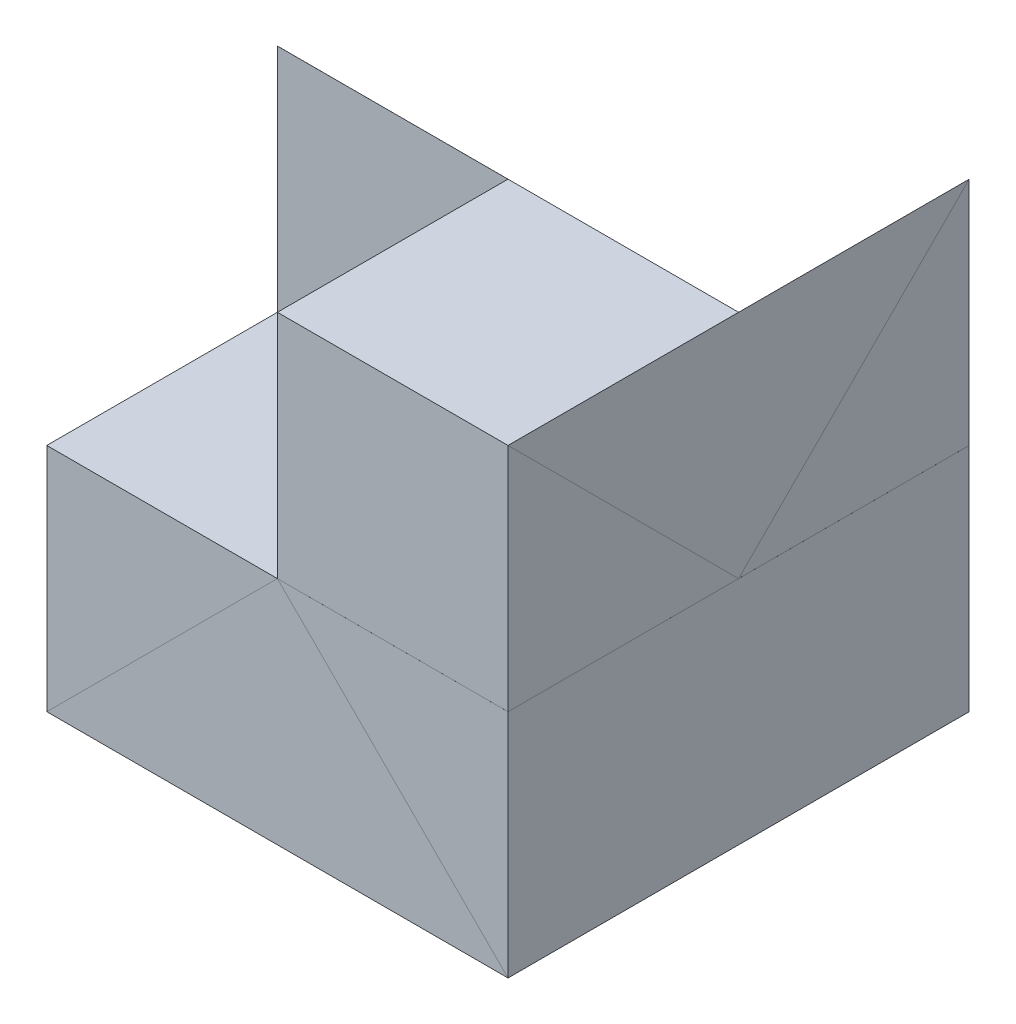
ISO-10303-21;
HEADER;
FILE_DESCRIPTION(('STEP AP214'),'2;1');
FILE_NAME('part.step','',(''),(''),'','','');
FILE_SCHEMA(('AUTOMOTIVE_DESIGN { 1 0 10303 214 1 1 1 1 }'));
ENDSEC;
DATA;
#1=APPLICATION_CONTEXT('core data for automotive mechanical design processes');
#2=APPLICATION_PROTOCOL_DEFINITION('international standard','automotive_design',2000,#1);
#3=PRODUCT_CONTEXT('',#1,'mechanical');
#4=PRODUCT('Part','Part','',(#3));
#5=PRODUCT_RELATED_PRODUCT_CATEGORY('part','',(#4));
#6=PRODUCT_DEFINITION_FORMATION('','',#4);
#7=PRODUCT_DEFINITION_CONTEXT('part definition',#1,'design');
#8=PRODUCT_DEFINITION('design','',#6,#7);
#9=PRODUCT_DEFINITION_SHAPE('','',#8);
#10=(LENGTH_UNIT() NAMED_UNIT(*) SI_UNIT(.MILLI.,.METRE.));
#11=(NAMED_UNIT(*) PLANE_ANGLE_UNIT() SI_UNIT($,.RADIAN.));
#12=(NAMED_UNIT(*) SI_UNIT($,.STERADIAN.) SOLID_ANGLE_UNIT());
#13=UNCERTAINTY_MEASURE_WITH_UNIT(LENGTH_MEASURE(1.E-05),#10,'distance_accuracy_value','');
#14=(GEOMETRIC_REPRESENTATION_CONTEXT(3) GLOBAL_UNCERTAINTY_ASSIGNED_CONTEXT((#13)) GLOBAL_UNIT_ASSIGNED_CONTEXT((#10,
#11,#12)) REPRESENTATION_CONTEXT('',''));
#15=CARTESIAN_POINT('',(0.,0.,0.));
#16=DIRECTION('',(0.,0.,1.));
#17=DIRECTION('',(1.,0.,0.));
#18=AXIS2_PLACEMENT_3D('',#15,#16,#17);
#19=CARTESIAN_POINT('',(0.,0.,30.));
#20=DIRECTION('',(-0.707106781186548,0.707106781186548,0.));
#21=DIRECTION('',(-0.707106781186548,-0.707106781186548,0.));
#22=AXIS2_PLACEMENT_3D('',#19,#20,#21);
#23=PLANE('',#22);
#24=DIRECTION('',(-0.707106781186547,-0.707106781186547,0.));
#25=VECTOR('',#24,1.);
#26=CARTESIAN_POINT('',(0.,0.,40.));
#27=LINE('',#26,#25);
#28=CARTESIAN_POINT('',(19.999,19.999,40.));
#29=VERTEX_POINT('',#28);
#30=CARTESIAN_POINT('',(0.,0.,40.));
#31=VERTEX_POINT('',#30);
#32=EDGE_CURVE('E280',#29,#31,#27,.T.);
#33=ORIENTED_EDGE('',*,*,#32,.T.);
#34=DIRECTION('',(0.577340646203995,0.577340646203995,-0.577369514679729));
#35=VECTOR('',#34,1.);
#36=CARTESIAN_POINT('',(3.33338888703682,3.33338888703682,36.6664444351849));
#37=LINE('',#36,#35);
#38=CARTESIAN_POINT('',(0.0001,9.99999999997031E-05,39.9998999949998));
#39=VERTEX_POINT('',#38);
#40=EDGE_CURVE('E200',#31,#39,#37,.T.);
#41=ORIENTED_EDGE('',*,*,#40,.T.);
#42=DIRECTION('',(0.,0.,-1.));
#43=VECTOR('',#42,1.);
#44=CARTESIAN_POINT('',(0.0001,0.0001,30.));
#45=LINE('',#44,#43);
#46=CARTESIAN_POINT('',(0.0001,0.0001,39.998));
#47=VERTEX_POINT('',#46);
#48=EDGE_CURVE('E178',#39,#47,#45,.T.);
#49=ORIENTED_EDGE('',*,*,#48,.T.);
#50=DIRECTION('',(-0.707106781186548,-0.707106781186547,0.));
#51=VECTOR('',#50,1.);
#52=CARTESIAN_POINT('',(0.,0.,39.998));
#53=LINE('',#52,#51);
#54=CARTESIAN_POINT('',(19.999,19.999,39.998));
#55=VERTEX_POINT('',#54);
#56=EDGE_CURVE('E203',#55,#47,#53,.T.);
#57=ORIENTED_EDGE('',*,*,#56,.F.);
#58=DIRECTION('',(0.,0.,1.));
#59=VECTOR('',#58,1.);
#60=CARTESIAN_POINT('',(19.999,19.999,30.));
#61=LINE('',#60,#59);
#62=EDGE_CURVE('E283',#55,#29,#61,.T.);
#63=ORIENTED_EDGE('',*,*,#62,.T.);
#64=EDGE_LOOP('',(#33,#41,#49,#57,#63));
#65=FACE_BOUND('',#64,.T.);
#66=ADVANCED_FACE('F33',(#65),#23,.F.);
#67=CARTESIAN_POINT('',(19.999,19.999,30.));
#68=DIRECTION('',(0.707071424963649,0.707142135641679,0.));
#69=DIRECTION('',(-0.707142135641679,0.707071424963649,0.));
#70=AXIS2_PLACEMENT_3D('',#67,#68,#69);
#71=PLANE('',#70);
#72=DIRECTION('',(-0.707142135641679,0.707071424963649,0.));
#73=VECTOR('',#72,1.);
#74=CARTESIAN_POINT('',(19.999,19.999,39.998));
#75=LINE('',#74,#73);
#76=CARTESIAN_POINT('',(40.,0.,39.998));
#77=VERTEX_POINT('',#76);
#78=EDGE_CURVE('E41',#77,#55,#75,.T.);
#79=ORIENTED_EDGE('',*,*,#78,.F.);
#80=DIRECTION('',(0.,0.,-1.));
#81=VECTOR('',#80,1.);
#82=CARTESIAN_POINT('',(40.,0.,40.));
#83=LINE('',#82,#81);
#84=CARTESIAN_POINT('',(40.,0.,40.));
#85=VERTEX_POINT('',#84);
#86=EDGE_CURVE('E326',#85,#77,#83,.T.);
#87=ORIENTED_EDGE('',*,*,#86,.F.);
#88=DIRECTION('',(-0.707142135641679,0.707071424963649,0.));
#89=VECTOR('',#88,1.);
#90=CARTESIAN_POINT('',(19.999,19.999,40.));
#91=LINE('',#90,#89);
#92=EDGE_CURVE('E277',#85,#29,#91,.T.);
#93=ORIENTED_EDGE('',*,*,#92,.T.);
#94=ORIENTED_EDGE('',*,*,#62,.F.);
#95=EDGE_LOOP('',(#79,#87,#93,#94));
#96=FACE_BOUND('',#95,.T.);
#97=ADVANCED_FACE('F340',(#96),#71,.F.);
#98=CARTESIAN_POINT('',(0.,0.,39.999));
#99=DIRECTION('',(0.,0.,-1.));
#100=DIRECTION('',(-1.,0.,0.));
#101=AXIS2_PLACEMENT_3D('',#98,#99,#100);
#102=PLANE('',#101);
#103=DIRECTION('',(0.,-1.,0.));
#104=VECTOR('',#103,1.);
#105=CARTESIAN_POINT('',(39.9999,0.,39.999));
#106=LINE('',#105,#104);
#107=CARTESIAN_POINT('',(39.9999,40.,39.999));
#108=VERTEX_POINT('',#107);
#109=CARTESIAN_POINT('',(39.9999,20.,39.999));
#110=VERTEX_POINT('',#109);
#111=EDGE_CURVE('E335',#108,#110,#106,.T.);
#112=ORIENTED_EDGE('',*,*,#111,.F.);
#113=DIRECTION('',(-1.,0.,0.));
#114=VECTOR('',#113,1.);
#115=CARTESIAN_POINT('',(40.,40.,39.999));
#116=LINE('',#115,#114);
#117=CARTESIAN_POINT('',(20.,40.,39.999));
#118=VERTEX_POINT('',#117);
#119=EDGE_CURVE('E235',#108,#118,#116,.T.);
#120=ORIENTED_EDGE('',*,*,#119,.T.);
#121=DIRECTION('',(0.,-1.,0.));
#122=VECTOR('',#121,1.);
#123=CARTESIAN_POINT('',(20.,40.,39.999));
#124=LINE('',#123,#122);
#125=CARTESIAN_POINT('',(20.,20.,39.999));
#126=VERTEX_POINT('',#125);
#127=EDGE_CURVE('E239',#118,#126,#124,.T.);
#128=ORIENTED_EDGE('',*,*,#127,.T.);
#129=DIRECTION('',(1.,0.,0.));
#130=VECTOR('',#129,1.);
#131=CARTESIAN_POINT('',(40.,20.,39.999));
#132=LINE('',#131,#130);
#133=EDGE_CURVE('E242',#126,#110,#132,.T.);
#134=ORIENTED_EDGE('',*,*,#133,.T.);
#135=EDGE_LOOP('',(#112,#120,#128,#134));
#136=FACE_BOUND('',#135,.T.);
#137=ADVANCED_FACE('F376',(#136),#102,.F.);
#138=CARTESIAN_POINT('',(40.,20.,20.));
#139=DIRECTION('',(0.,-1.,0.));
#140=DIRECTION('',(1.,0.,0.));
#141=AXIS2_PLACEMENT_3D('',#138,#139,#140);
#142=PLANE('',#141);
#143=DIRECTION('',(0.,0.,1.));
#144=VECTOR('',#143,1.);
#145=CARTESIAN_POINT('',(40.,20.,20.));
#146=LINE('',#145,#144);
#147=CARTESIAN_POINT('',(40.,20.,20.001));
#148=VERTEX_POINT('',#147);
#149=CARTESIAN_POINT('',(40.,20.,40.));
#150=VERTEX_POINT('',#149);
#151=EDGE_CURVE('E303',#148,#150,#146,.T.);
#152=ORIENTED_EDGE('',*,*,#151,.F.);
#153=DIRECTION('',(1.,0.,0.));
#154=VECTOR('',#153,1.);
#155=CARTESIAN_POINT('',(39.9999,20.,20.001));
#156=LINE('',#155,#154);
#157=CARTESIAN_POINT('',(39.9999,20.,20.001));
#158=VERTEX_POINT('',#157);
#159=EDGE_CURVE('E231',#158,#148,#156,.T.);
#160=ORIENTED_EDGE('',*,*,#159,.F.);
#161=DIRECTION('',(0.,0.,-1.));
#162=VECTOR('',#161,1.);
#163=CARTESIAN_POINT('',(39.9999,20.,40.));
#164=LINE('',#163,#162);
#165=EDGE_CURVE('E227',#110,#158,#164,.T.);
#166=ORIENTED_EDGE('',*,*,#165,.F.);
#167=ORIENTED_EDGE('',*,*,#133,.F.);
#168=DIRECTION('',(0.,0.,-1.));
#169=VECTOR('',#168,1.);
#170=CARTESIAN_POINT('',(20.,20.,39.999));
#171=LINE('',#170,#169);
#172=CARTESIAN_POINT('',(20.,20.,20.002));
#173=VERTEX_POINT('',#172);
#174=EDGE_CURVE('E245',#126,#173,#171,.T.);
#175=ORIENTED_EDGE('',*,*,#174,.T.);
#176=DIRECTION('',(1.,0.,0.));
#177=VECTOR('',#176,1.);
#178=CARTESIAN_POINT('',(0.,20.,20.002));
#179=LINE('',#178,#177);
#180=CARTESIAN_POINT('',(0.,20.,20.002));
#181=VERTEX_POINT('',#180);
#182=EDGE_CURVE('E209',#181,#173,#179,.T.);
#183=ORIENTED_EDGE('',*,*,#182,.F.);
#184=DIRECTION('',(0.,0.,1.));
#185=VECTOR('',#184,1.);
#186=CARTESIAN_POINT('',(0.,20.,30.));
#187=LINE('',#186,#185);
#188=CARTESIAN_POINT('',(0.,20.,40.));
#189=VERTEX_POINT('',#188);
#190=EDGE_CURVE('E296',#181,#189,#187,.T.);
#191=ORIENTED_EDGE('',*,*,#190,.T.);
#192=DIRECTION('',(1.,0.,0.));
#193=VECTOR('',#192,1.);
#194=CARTESIAN_POINT('',(40.,20.,40.));
#195=LINE('',#194,#193);
#196=EDGE_CURVE('E301',#189,#150,#195,.T.);
#197=ORIENTED_EDGE('',*,*,#196,.T.);
#198=EDGE_LOOP('',(#152,#160,#166,#167,#175,#183,#191,#197));
#199=FACE_BOUND('',#198,.T.);
#200=ADVANCED_FACE('F390',(#199),#142,.F.);
#201=CARTESIAN_POINT('',(0.,40.,40.));
#202=DIRECTION('',(0.,-1.,0.));
#203=DIRECTION('',(0.,0.,-1.));
#204=AXIS2_PLACEMENT_3D('',#201,#202,#203);
#205=PLANE('',#204);
#206=DIRECTION('',(-1.,0.,0.));
#207=VECTOR('',#206,1.);
#208=CARTESIAN_POINT('',(0.,40.,20.002));
#209=LINE('',#208,#207);
#210=CARTESIAN_POINT('',(20.,40.,20.002));
#211=VERTEX_POINT('',#210);
#212=CARTESIAN_POINT('',(0.,40.,20.002));
#213=VERTEX_POINT('',#212);
#214=EDGE_CURVE('E215',#211,#213,#209,.T.);
#215=ORIENTED_EDGE('',*,*,#214,.F.);
#216=DIRECTION('',(0.,0.,-1.));
#217=VECTOR('',#216,1.);
#218=CARTESIAN_POINT('',(20.,40.,39.999));
#219=LINE('',#218,#217);
#220=EDGE_CURVE('E247',#118,#211,#219,.T.);
#221=ORIENTED_EDGE('',*,*,#220,.F.);
#222=ORIENTED_EDGE('',*,*,#119,.F.);
#223=CARTESIAN_POINT('',(40.,40.,39.999));
#224=VERTEX_POINT('',#223);
#225=EDGE_CURVE('E236',#224,#108,#116,.T.);
#226=ORIENTED_EDGE('',*,*,#225,.F.);
#227=DIRECTION('',(0.,0.,-1.));
#228=VECTOR('',#227,1.);
#229=CARTESIAN_POINT('',(40.,40.,40.));
#230=LINE('',#229,#228);
#231=CARTESIAN_POINT('',(40.,40.,20.));
#232=VERTEX_POINT('',#231);
#233=EDGE_CURVE('E322',#224,#232,#230,.T.);
#234=ORIENTED_EDGE('',*,*,#233,.T.);
#235=DIRECTION('',(1.,0.,0.));
#236=VECTOR('',#235,1.);
#237=CARTESIAN_POINT('',(0.,40.,20.));
#238=LINE('',#237,#236);
#239=CARTESIAN_POINT('',(0.,40.,20.));
#240=VERTEX_POINT('',#239);
#241=EDGE_CURVE('E285',#240,#232,#238,.T.);
#242=ORIENTED_EDGE('',*,*,#241,.F.);
#243=DIRECTION('',(0.,0.,-1.));
#244=VECTOR('',#243,1.);
#245=CARTESIAN_POINT('',(0.,40.,20.001));
#246=LINE('',#245,#244);
#247=CARTESIAN_POINT('',(0.,40.,20.0009));
#248=VERTEX_POINT('',#247);
#249=EDGE_CURVE('E269',#248,#240,#246,.T.);
#250=ORIENTED_EDGE('',*,*,#249,.F.);
#251=DIRECTION('',(0.,0.,-1.));
#252=VECTOR('',#251,1.);
#253=CARTESIAN_POINT('',(0.,40.,40.));
#254=LINE('',#253,#252);
#255=EDGE_CURVE('E314',#213,#248,#254,.T.);
#256=ORIENTED_EDGE('',*,*,#255,.F.);
#257=EDGE_LOOP('',(#215,#221,#222,#226,#234,#242,#250,#256));
#258=FACE_BOUND('',#257,.T.);
#259=ADVANCED_FACE('F370',(#258),#205,.F.);
#260=CARTESIAN_POINT('',(0.,0.,40.));
#261=DIRECTION('',(1.,0.,0.));
#262=DIRECTION('',(0.,0.,-1.));
#263=AXIS2_PLACEMENT_3D('',#260,#261,#262);
#264=PLANE('',#263);
#265=DIRECTION('',(0.,-1.,0.));
#266=VECTOR('',#265,1.);
#267=CARTESIAN_POINT('',(0.,0.,0.));
#268=LINE('',#267,#266);
#269=CARTESIAN_POINT('',(0.,20.,0.));
#270=VERTEX_POINT('',#269);
#271=CARTESIAN_POINT('',(0.,0.,0.));
#272=VERTEX_POINT('',#271);
#273=EDGE_CURVE('E306',#270,#272,#268,.T.);
#274=ORIENTED_EDGE('',*,*,#273,.T.);
#275=DIRECTION('',(0.,-0.707089102854089,-0.707124459077042));
#276=VECTOR('',#275,1.);
#277=CARTESIAN_POINT('',(0.,0.,0.));
#278=LINE('',#277,#276);
#279=CARTESIAN_POINT('',(0.,19.999,20.));
#280=VERTEX_POINT('',#279);
#281=EDGE_CURVE('E197',#280,#272,#278,.T.);
#282=ORIENTED_EDGE('',*,*,#281,.F.);
#283=DIRECTION('',(0.,0.707089102854089,-0.707124459077042));
#284=VECTOR('',#283,1.);
#285=CARTESIAN_POINT('',(0.,19.999,20.));
#286=LINE('',#285,#284);
#287=EDGE_CURVE('E186',#31,#280,#286,.T.);
#288=ORIENTED_EDGE('',*,*,#287,.F.);
#289=DIRECTION('',(0.,-1.,0.));
#290=VECTOR('',#289,1.);
#291=CARTESIAN_POINT('',(0.,0.,40.));
#292=LINE('',#291,#290);
#293=EDGE_CURVE('E307',#189,#31,#292,.T.);
#294=ORIENTED_EDGE('',*,*,#293,.F.);
#295=ORIENTED_EDGE('',*,*,#190,.F.);
#296=DIRECTION('',(0.,-1.,0.));
#297=VECTOR('',#296,1.);
#298=CARTESIAN_POINT('',(0.,40.,20.002));
#299=LINE('',#298,#297);
#300=EDGE_CURVE('E206',#213,#181,#299,.T.);
#301=ORIENTED_EDGE('',*,*,#300,.F.);
#302=ORIENTED_EDGE('',*,*,#255,.T.);
#303=DIRECTION('',(0.,1.,0.));
#304=VECTOR('',#303,1.);
#305=CARTESIAN_POINT('',(0.,20.,20.0009));
#306=LINE('',#305,#304);
#307=CARTESIAN_POINT('',(0.,20.,20.0009));
#308=VERTEX_POINT('',#307);
#309=EDGE_CURVE('E223',#308,#248,#306,.T.);
#310=ORIENTED_EDGE('',*,*,#309,.F.);
#311=DIRECTION('',(0.,0.,1.));
#312=VECTOR('',#311,1.);
#313=CARTESIAN_POINT('',(0.,20.,0.));
#314=LINE('',#313,#312);
#315=EDGE_CURVE('E272',#270,#308,#314,.T.);
#316=ORIENTED_EDGE('',*,*,#315,.F.);
#317=EDGE_LOOP('',(#274,#282,#288,#294,#295,#301,#302,#310,#316));
#318=FACE_BOUND('',#317,.T.);
#319=ADVANCED_FACE('F35',(#318),#264,.F.);
#320=CARTESIAN_POINT('',(0.,0.,40.));
#321=DIRECTION('',(0.,1.,0.));
#322=DIRECTION('',(0.,0.,1.));
#323=AXIS2_PLACEMENT_3D('',#320,#321,#322);
#324=PLANE('',#323);
#325=DIRECTION('',(1.,0.,0.));
#326=VECTOR('',#325,1.);
#327=CARTESIAN_POINT('',(40.,0.,39.998));
#328=LINE('',#327,#326);
#329=CARTESIAN_POINT('',(0.000100000000002876,0.,39.998));
#330=VERTEX_POINT('',#329);
#331=EDGE_CURVE('E54',#330,#77,#328,.T.);
#332=ORIENTED_EDGE('',*,*,#331,.F.);
#333=DIRECTION('',(0.,0.,1.));
#334=VECTOR('',#333,1.);
#335=CARTESIAN_POINT('',(0.0001,0.,40.));
#336=LINE('',#335,#334);
#337=CARTESIAN_POINT('',(0.0001,0.,0.));
#338=VERTEX_POINT('',#337);
#339=EDGE_CURVE('E48',#338,#330,#336,.T.);
#340=ORIENTED_EDGE('',*,*,#339,.F.);
#341=DIRECTION('',(1.,0.,0.));
#342=VECTOR('',#341,1.);
#343=CARTESIAN_POINT('',(0.,0.,0.));
#344=LINE('',#343,#342);
#345=CARTESIAN_POINT('',(40.,0.,0.));
#346=VERTEX_POINT('',#345);
#347=EDGE_CURVE('E317',#338,#346,#344,.T.);
#348=ORIENTED_EDGE('',*,*,#347,.T.);
#349=EDGE_CURVE('E325',#77,#346,#83,.T.);
#350=ORIENTED_EDGE('',*,*,#349,.F.);
#351=EDGE_LOOP('',(#332,#340,#348,#350));
#352=FACE_BOUND('',#351,.T.);
#353=ADVANCED_FACE('F363',(#352),#324,.F.);
#354=CARTESIAN_POINT('',(40.,0.,40.));
#355=DIRECTION('',(-1.,0.,0.));
#356=DIRECTION('',(0.,0.,1.));
#357=AXIS2_PLACEMENT_3D('',#354,#355,#356);
#358=PLANE('',#357);
#359=ORIENTED_EDGE('',*,*,#233,.F.);
#360=DIRECTION('',(0.,0.707142137409446,0.707071423195705));
#361=VECTOR('',#360,1.);
#362=CARTESIAN_POINT('',(40.,20.,20.001));
#363=LINE('',#362,#361);
#364=EDGE_CURVE('E226',#148,#224,#363,.T.);
#365=ORIENTED_EDGE('',*,*,#364,.F.);
#366=ORIENTED_EDGE('',*,*,#151,.T.);
#367=DIRECTION('',(0.,1.,0.));
#368=VECTOR('',#367,1.);
#369=CARTESIAN_POINT('',(40.,0.,40.));
#370=LINE('',#369,#368);
#371=EDGE_CURVE('E310',#85,#150,#370,.T.);
#372=ORIENTED_EDGE('',*,*,#371,.F.);
#373=ORIENTED_EDGE('',*,*,#86,.T.);
#374=ORIENTED_EDGE('',*,*,#349,.T.);
#375=DIRECTION('',(0.,1.,0.));
#376=VECTOR('',#375,1.);
#377=CARTESIAN_POINT('',(40.,0.,0.));
#378=LINE('',#377,#376);
#379=CARTESIAN_POINT('',(40.,20.,0.));
#380=VERTEX_POINT('',#379);
#381=EDGE_CURVE('E311',#346,#380,#378,.T.);
#382=ORIENTED_EDGE('',*,*,#381,.T.);
#383=DIRECTION('',(0.,0.,-1.));
#384=VECTOR('',#383,1.);
#385=CARTESIAN_POINT('',(40.,20.,20.));
#386=LINE('',#385,#384);
#387=CARTESIAN_POINT('',(40.,20.,20.));
#388=VERTEX_POINT('',#387);
#389=EDGE_CURVE('E253',#388,#380,#386,.T.);
#390=ORIENTED_EDGE('',*,*,#389,.F.);
#391=DIRECTION('',(0.,-0.707106781186548,0.707106781186548));
#392=VECTOR('',#391,1.);
#393=CARTESIAN_POINT('',(40.,40.,0.));
#394=LINE('',#393,#392);
#395=CARTESIAN_POINT('',(40.,40.,0.));
#396=VERTEX_POINT('',#395);
#397=EDGE_CURVE('E249',#396,#388,#394,.T.);
#398=ORIENTED_EDGE('',*,*,#397,.F.);
#399=DIRECTION('',(0.,0.,-1.));
#400=VECTOR('',#399,1.);
#401=CARTESIAN_POINT('',(40.,40.,10.));
#402=LINE('',#401,#400);
#403=EDGE_CURVE('E292',#232,#396,#402,.T.);
#404=ORIENTED_EDGE('',*,*,#403,.F.);
#405=EDGE_LOOP('',(#359,#365,#366,#372,#373,#374,#382,#390,#398,#404));
#406=FACE_BOUND('',#405,.T.);
#407=ADVANCED_FACE('F346',(#406),#358,.F.);
#408=CARTESIAN_POINT('',(0.,0.,40.));
#409=DIRECTION('',(0.,0.,-1.));
#410=DIRECTION('',(-1.,0.,0.));
#411=AXIS2_PLACEMENT_3D('',#408,#409,#410);
#412=PLANE('',#411);
#413=ORIENTED_EDGE('',*,*,#293,.T.);
#414=ORIENTED_EDGE('',*,*,#32,.F.);
#415=ORIENTED_EDGE('',*,*,#92,.F.);
#416=ORIENTED_EDGE('',*,*,#371,.T.);
#417=ORIENTED_EDGE('',*,*,#196,.F.);
#418=EDGE_LOOP('',(#413,#414,#415,#416,#417));
#419=FACE_BOUND('',#418,.T.);
#420=ADVANCED_FACE('F350',(#419),#412,.F.);
#421=CARTESIAN_POINT('',(0.,0.,0.));
#422=DIRECTION('',(0.,0.,-1.));
#423=DIRECTION('',(-1.,0.,0.));
#424=AXIS2_PLACEMENT_3D('',#421,#422,#423);
#425=PLANE('',#424);
#426=DIRECTION('',(1.,0.,0.));
#427=VECTOR('',#426,1.);
#428=CARTESIAN_POINT('',(39.999,20.,0.));
#429=LINE('',#428,#427);
#430=CARTESIAN_POINT('',(39.999,20.,0.));
#431=VERTEX_POINT('',#430);
#432=EDGE_CURVE('E262',#431,#380,#429,.T.);
#433=ORIENTED_EDGE('',*,*,#432,.T.);
#434=ORIENTED_EDGE('',*,*,#381,.F.);
#435=ORIENTED_EDGE('',*,*,#347,.F.);
#436=EDGE_CURVE('E192',#272,#338,#344,.T.);
#437=ORIENTED_EDGE('',*,*,#436,.F.);
#438=ORIENTED_EDGE('',*,*,#273,.F.);
#439=DIRECTION('',(-1.,0.,0.));
#440=VECTOR('',#439,1.);
#441=CARTESIAN_POINT('',(20.,20.,0.));
#442=LINE('',#441,#440);
#443=CARTESIAN_POINT('',(20.,20.,0.));
#444=VERTEX_POINT('',#443);
#445=EDGE_CURVE('E275',#444,#270,#442,.T.);
#446=ORIENTED_EDGE('',*,*,#445,.F.);
#447=DIRECTION('',(-0.707106781186548,-0.707106781186547,0.));
#448=VECTOR('',#447,1.);
#449=CARTESIAN_POINT('',(40.,40.,0.));
#450=LINE('',#449,#448);
#451=CARTESIAN_POINT('',(39.999,39.999,0.));
#452=VERTEX_POINT('',#451);
#453=EDGE_CURVE('E290',#452,#444,#450,.T.);
#454=ORIENTED_EDGE('',*,*,#453,.F.);
#455=DIRECTION('',(0.,1.,0.));
#456=VECTOR('',#455,1.);
#457=CARTESIAN_POINT('',(39.999,20.,0.));
#458=LINE('',#457,#456);
#459=EDGE_CURVE('E250',#431,#452,#458,.T.);
#460=ORIENTED_EDGE('',*,*,#459,.F.);
#461=EDGE_LOOP('',(#433,#434,#435,#437,#438,#446,#454,#460));
#462=FACE_BOUND('',#461,.T.);
#463=ADVANCED_FACE('F361',(#462),#425,.T.);
#464=CARTESIAN_POINT('',(40.,40.,10.));
#465=DIRECTION('',(0.707106781186547,-0.707106781186548,0.));
#466=DIRECTION('',(0.707106781186548,0.707106781186547,0.));
#467=AXIS2_PLACEMENT_3D('',#464,#465,#466);
#468=PLANE('',#467);
#469=ORIENTED_EDGE('',*,*,#403,.T.);
#470=DIRECTION('',(-0.577350269189626,-0.577350269189626,0.577350269189626));
#471=VECTOR('',#470,1.);
#472=CARTESIAN_POINT('',(36.6666666666667,36.6666666666667,3.33333333333333));
#473=LINE('',#472,#471);
#474=CARTESIAN_POINT('',(39.999,39.999,0.00100000000000093));
#475=VERTEX_POINT('',#474);
#476=EDGE_CURVE('E332',#396,#475,#473,.T.);
#477=ORIENTED_EDGE('',*,*,#476,.T.);
#478=DIRECTION('',(0.,0.,-1.));
#479=VECTOR('',#478,1.);
#480=CARTESIAN_POINT('',(39.999,39.999,10.));
#481=LINE('',#480,#479);
#482=EDGE_CURVE('E329',#475,#452,#481,.T.);
#483=ORIENTED_EDGE('',*,*,#482,.T.);
#484=ORIENTED_EDGE('',*,*,#453,.T.);
#485=DIRECTION('',(0.,0.,-1.));
#486=VECTOR('',#485,1.);
#487=CARTESIAN_POINT('',(20.,20.,10.));
#488=LINE('',#487,#486);
#489=CARTESIAN_POINT('',(20.,20.,20.));
#490=VERTEX_POINT('',#489);
#491=EDGE_CURVE('E293',#490,#444,#488,.T.);
#492=ORIENTED_EDGE('',*,*,#491,.F.);
#493=DIRECTION('',(-0.707106781186548,-0.707106781186547,0.));
#494=VECTOR('',#493,1.);
#495=CARTESIAN_POINT('',(40.,40.,20.));
#496=LINE('',#495,#494);
#497=EDGE_CURVE('E287',#232,#490,#496,.T.);
#498=ORIENTED_EDGE('',*,*,#497,.F.);
#499=EDGE_LOOP('',(#469,#477,#483,#484,#492,#498));
#500=FACE_BOUND('',#499,.T.);
#501=ADVANCED_FACE('F385',(#500),#468,.F.);
#502=CARTESIAN_POINT('',(0.,0.,20.));
#503=DIRECTION('',(0.,0.,-1.));
#504=DIRECTION('',(-1.,0.,0.));
#505=AXIS2_PLACEMENT_3D('',#502,#503,#504);
#506=PLANE('',#505);
#507=DIRECTION('',(0.707106781186547,-0.707106781186548,0.));
#508=VECTOR('',#507,1.);
#509=CARTESIAN_POINT('',(20.,20.,20.));
#510=LINE('',#509,#508);
#511=EDGE_CURVE('E265',#240,#490,#510,.T.);
#512=ORIENTED_EDGE('',*,*,#511,.F.);
#513=ORIENTED_EDGE('',*,*,#241,.T.);
#514=ORIENTED_EDGE('',*,*,#497,.T.);
#515=EDGE_LOOP('',(#512,#513,#514));
#516=FACE_BOUND('',#515,.T.);
#517=ADVANCED_FACE('F382',(#516),#506,.T.);
#518=CARTESIAN_POINT('',(20.,20.,0.));
#519=DIRECTION('',(0.,-1.,0.));
#520=DIRECTION('',(0.,0.,-1.));
#521=AXIS2_PLACEMENT_3D('',#518,#519,#520);
#522=PLANE('',#521);
#523=ORIENTED_EDGE('',*,*,#315,.T.);
#524=DIRECTION('',(-1.,0.,0.));
#525=VECTOR('',#524,1.);
#526=CARTESIAN_POINT('',(20.,20.,20.0009));
#527=LINE('',#526,#525);
#528=CARTESIAN_POINT('',(20.,20.,20.0009));
#529=VERTEX_POINT('',#528);
#530=EDGE_CURVE('E220',#529,#308,#527,.T.);
#531=ORIENTED_EDGE('',*,*,#530,.F.);
#532=DIRECTION('',(0.,0.,-1.));
#533=VECTOR('',#532,1.);
#534=CARTESIAN_POINT('',(20.,20.,20.001));
#535=LINE('',#534,#533);
#536=EDGE_CURVE('E270',#529,#490,#535,.T.);
#537=ORIENTED_EDGE('',*,*,#536,.T.);
#538=ORIENTED_EDGE('',*,*,#491,.T.);
#539=ORIENTED_EDGE('',*,*,#445,.T.);
#540=EDGE_LOOP('',(#523,#531,#537,#538,#539));
#541=FACE_BOUND('',#540,.T.);
#542=ADVANCED_FACE('F379',(#541),#522,.F.);
#543=CARTESIAN_POINT('',(20.,20.,20.001));
#544=DIRECTION('',(0.707106781186548,0.707106781186547,0.));
#545=DIRECTION('',(-0.707106781186547,0.707106781186548,0.));
#546=AXIS2_PLACEMENT_3D('',#543,#544,#545);
#547=PLANE('',#546);
#548=ORIENTED_EDGE('',*,*,#536,.F.);
#549=DIRECTION('',(0.707106781186548,-0.707106781186548,0.));
#550=VECTOR('',#549,1.);
#551=CARTESIAN_POINT('',(0.,40.,20.0009));
#552=LINE('',#551,#550);
#553=EDGE_CURVE('E217',#248,#529,#552,.T.);
#554=ORIENTED_EDGE('',*,*,#553,.F.);
#555=ORIENTED_EDGE('',*,*,#249,.T.);
#556=ORIENTED_EDGE('',*,*,#511,.T.);
#557=EDGE_LOOP('',(#548,#554,#555,#556));
#558=FACE_BOUND('',#557,.T.);
#559=ADVANCED_FACE('F437',(#558),#547,.F.);
#560=CARTESIAN_POINT('',(39.999,40.,0.));
#561=DIRECTION('',(0.,0.707106781186547,0.707106781186547));
#562=DIRECTION('',(0.,-0.707106781186548,0.707106781186548));
#563=AXIS2_PLACEMENT_3D('',#560,#561,#562);
#564=PLANE('',#563);
#565=ORIENTED_EDGE('',*,*,#397,.T.);
#566=DIRECTION('',(1.,0.,0.));
#567=VECTOR('',#566,1.);
#568=CARTESIAN_POINT('',(39.999,20.,20.));
#569=LINE('',#568,#567);
#570=CARTESIAN_POINT('',(39.999,20.,20.));
#571=VERTEX_POINT('',#570);
#572=EDGE_CURVE('E258',#571,#388,#569,.T.);
#573=ORIENTED_EDGE('',*,*,#572,.F.);
#574=DIRECTION('',(0.,-0.707106781186548,0.707106781186548));
#575=VECTOR('',#574,1.);
#576=CARTESIAN_POINT('',(39.999,40.,0.));
#577=LINE('',#576,#575);
#578=EDGE_CURVE('E252',#475,#571,#577,.T.);
#579=ORIENTED_EDGE('',*,*,#578,.F.);
#580=ORIENTED_EDGE('',*,*,#476,.F.);
#581=EDGE_LOOP('',(#565,#573,#579,#580));
#582=FACE_BOUND('',#581,.T.);
#583=ADVANCED_FACE('F439',(#582),#564,.F.);
#584=CARTESIAN_POINT('',(39.999,0.,0.));
#585=DIRECTION('',(-1.,0.,0.));
#586=DIRECTION('',(0.,0.,1.));
#587=AXIS2_PLACEMENT_3D('',#584,#585,#586);
#588=PLANE('',#587);
#589=ORIENTED_EDGE('',*,*,#578,.T.);
#590=DIRECTION('',(0.,0.,-1.));
#591=VECTOR('',#590,1.);
#592=CARTESIAN_POINT('',(39.999,20.,20.));
#593=LINE('',#592,#591);
#594=EDGE_CURVE('E255',#571,#431,#593,.T.);
#595=ORIENTED_EDGE('',*,*,#594,.T.);
#596=ORIENTED_EDGE('',*,*,#459,.T.);
#597=ORIENTED_EDGE('',*,*,#482,.F.);
#598=EDGE_LOOP('',(#589,#595,#596,#597));
#599=FACE_BOUND('',#598,.T.);
#600=ADVANCED_FACE('F444',(#599),#588,.F.);
#601=CARTESIAN_POINT('',(39.999,20.,20.));
#602=DIRECTION('',(0.,-1.,0.));
#603=DIRECTION('',(0.,0.,-1.));
#604=AXIS2_PLACEMENT_3D('',#601,#602,#603);
#605=PLANE('',#604);
#606=ORIENTED_EDGE('',*,*,#389,.T.);
#607=ORIENTED_EDGE('',*,*,#432,.F.);
#608=ORIENTED_EDGE('',*,*,#594,.F.);
#609=ORIENTED_EDGE('',*,*,#572,.T.);
#610=EDGE_LOOP('',(#606,#607,#608,#609));
#611=FACE_BOUND('',#610,.T.);
#612=ADVANCED_FACE('F448',(#611),#605,.F.);
#613=CARTESIAN_POINT('',(20.,40.,39.999));
#614=DIRECTION('',(1.,0.,0.));
#615=DIRECTION('',(0.,0.,-1.));
#616=AXIS2_PLACEMENT_3D('',#613,#614,#615);
#617=PLANE('',#616);
#618=ORIENTED_EDGE('',*,*,#220,.T.);
#619=DIRECTION('',(0.,1.,0.));
#620=VECTOR('',#619,1.);
#621=CARTESIAN_POINT('',(20.,40.,20.002));
#622=LINE('',#621,#620);
#623=EDGE_CURVE('E212',#173,#211,#622,.T.);
#624=ORIENTED_EDGE('',*,*,#623,.F.);
#625=ORIENTED_EDGE('',*,*,#174,.F.);
#626=ORIENTED_EDGE('',*,*,#127,.F.);
#627=EDGE_LOOP('',(#618,#624,#625,#626));
#628=FACE_BOUND('',#627,.T.);
#629=ADVANCED_FACE('F417',(#628),#617,.F.);
#630=CARTESIAN_POINT('',(39.9999,0.,0.));
#631=DIRECTION('',(1.,0.,0.));
#632=DIRECTION('',(0.,0.,-1.));
#633=AXIS2_PLACEMENT_3D('',#630,#631,#632);
#634=PLANE('',#633);
#635=ORIENTED_EDGE('',*,*,#111,.T.);
#636=ORIENTED_EDGE('',*,*,#165,.T.);
#637=DIRECTION('',(0.,0.707142137409446,0.707071423195705));
#638=VECTOR('',#637,1.);
#639=CARTESIAN_POINT('',(39.9999,20.,20.001));
#640=LINE('',#639,#638);
#641=EDGE_CURVE('E229',#158,#108,#640,.T.);
#642=ORIENTED_EDGE('',*,*,#641,.T.);
#643=EDGE_LOOP('',(#635,#636,#642));
#644=FACE_BOUND('',#643,.T.);
#645=ADVANCED_FACE('F457',(#644),#634,.T.);
#646=CARTESIAN_POINT('',(39.9999,20.,20.001));
#647=DIRECTION('',(0.,0.707071423195705,-0.707142137409446));
#648=DIRECTION('',(0.,0.707142137409446,0.707071423195705));
#649=AXIS2_PLACEMENT_3D('',#646,#647,#648);
#650=PLANE('',#649);
#651=ORIENTED_EDGE('',*,*,#364,.T.);
#652=ORIENTED_EDGE('',*,*,#225,.T.);
#653=ORIENTED_EDGE('',*,*,#641,.F.);
#654=ORIENTED_EDGE('',*,*,#159,.T.);
#655=EDGE_LOOP('',(#651,#652,#653,#654));
#656=FACE_BOUND('',#655,.T.);
#657=ADVANCED_FACE('F425',(#656),#650,.F.);
#658=CARTESIAN_POINT('',(0.,0.,20.0009));
#659=DIRECTION('',(0.,0.,-1.));
#660=DIRECTION('',(-1.,0.,0.));
#661=AXIS2_PLACEMENT_3D('',#658,#659,#660);
#662=PLANE('',#661);
#663=ORIENTED_EDGE('',*,*,#553,.T.);
#664=ORIENTED_EDGE('',*,*,#530,.T.);
#665=ORIENTED_EDGE('',*,*,#309,.T.);
#666=EDGE_LOOP('',(#663,#664,#665));
#667=FACE_BOUND('',#666,.T.);
#668=ADVANCED_FACE('F434',(#667),#662,.T.);
#669=CARTESIAN_POINT('',(0.,0.,20.002));
#670=DIRECTION('',(0.,0.,1.));
#671=DIRECTION('',(1.,0.,0.));
#672=AXIS2_PLACEMENT_3D('',#669,#670,#671);
#673=PLANE('',#672);
#674=ORIENTED_EDGE('',*,*,#300,.T.);
#675=ORIENTED_EDGE('',*,*,#182,.T.);
#676=ORIENTED_EDGE('',*,*,#623,.T.);
#677=ORIENTED_EDGE('',*,*,#214,.T.);
#678=EDGE_LOOP('',(#674,#675,#676,#677));
#679=FACE_BOUND('',#678,.T.);
#680=ADVANCED_FACE('F410',(#679),#673,.T.);
#681=CARTESIAN_POINT('',(0.,0.,39.998));
#682=DIRECTION('',(0.,0.,-1.));
#683=DIRECTION('',(-1.,0.,0.));
#684=AXIS2_PLACEMENT_3D('',#681,#682,#683);
#685=PLANE('',#684);
#686=ORIENTED_EDGE('',*,*,#56,.T.);
#687=DIRECTION('',(0.,-1.,0.));
#688=VECTOR('',#687,1.);
#689=CARTESIAN_POINT('',(0.0001,0.,39.998));
#690=LINE('',#689,#688);
#691=EDGE_CURVE('E11',#47,#330,#690,.T.);
#692=ORIENTED_EDGE('',*,*,#691,.T.);
#693=ORIENTED_EDGE('',*,*,#331,.T.);
#694=ORIENTED_EDGE('',*,*,#78,.T.);
#695=EDGE_LOOP('',(#686,#692,#693,#694));
#696=FACE_BOUND('',#695,.T.);
#697=ADVANCED_FACE('F337',(#696),#685,.F.);
#698=CARTESIAN_POINT('',(0.0001,19.999,20.));
#699=DIRECTION('',(0.,0.707124459077043,0.707089102854089));
#700=DIRECTION('',(0.,-0.707089102854089,0.707124459077043));
#701=AXIS2_PLACEMENT_3D('',#698,#699,#700);
#702=PLANE('',#701);
#703=ORIENTED_EDGE('',*,*,#287,.T.);
#704=DIRECTION('',(-1.,0.,0.));
#705=VECTOR('',#704,1.);
#706=CARTESIAN_POINT('',(0.0001,19.999,20.));
#707=LINE('',#706,#705);
#708=CARTESIAN_POINT('',(0.0001,19.999,20.));
#709=VERTEX_POINT('',#708);
#710=EDGE_CURVE('E183',#709,#280,#707,.T.);
#711=ORIENTED_EDGE('',*,*,#710,.F.);
#712=DIRECTION('',(0.,0.707089102854089,-0.707124459077042));
#713=VECTOR('',#712,1.);
#714=CARTESIAN_POINT('',(0.0001,19.999,20.));
#715=LINE('',#714,#713);
#716=EDGE_CURVE('E172',#39,#709,#715,.T.);
#717=ORIENTED_EDGE('',*,*,#716,.F.);
#718=ORIENTED_EDGE('',*,*,#40,.F.);
#719=EDGE_LOOP('',(#703,#711,#717,#718));
#720=FACE_BOUND('',#719,.T.);
#721=ADVANCED_FACE('F184',(#720),#702,.F.);
#722=CARTESIAN_POINT('',(0.0001,0.,0.));
#723=DIRECTION('',(1.,0.,0.));
#724=DIRECTION('',(0.,0.,-1.));
#725=AXIS2_PLACEMENT_3D('',#722,#723,#724);
#726=PLANE('',#725);
#727=ORIENTED_EDGE('',*,*,#716,.T.);
#728=DIRECTION('',(0.,-0.707089102854089,-0.707124459077042));
#729=VECTOR('',#728,1.);
#730=CARTESIAN_POINT('',(0.0001,0.,0.));
#731=LINE('',#730,#729);
#732=EDGE_CURVE('E176',#709,#338,#731,.T.);
#733=ORIENTED_EDGE('',*,*,#732,.T.);
#734=ORIENTED_EDGE('',*,*,#339,.T.);
#735=ORIENTED_EDGE('',*,*,#691,.F.);
#736=ORIENTED_EDGE('',*,*,#48,.F.);
#737=EDGE_LOOP('',(#727,#733,#734,#735,#736));
#738=FACE_BOUND('',#737,.T.);
#739=ADVANCED_FACE('F174',(#738),#726,.F.);
#740=CARTESIAN_POINT('',(0.0001,0.,0.));
#741=DIRECTION('',(0.,0.707124459077043,-0.707089102854089));
#742=DIRECTION('',(0.,0.707089102854089,0.707124459077043));
#743=AXIS2_PLACEMENT_3D('',#740,#741,#742);
#744=PLANE('',#743);
#745=ORIENTED_EDGE('',*,*,#281,.T.);
#746=ORIENTED_EDGE('',*,*,#436,.T.);
#747=ORIENTED_EDGE('',*,*,#732,.F.);
#748=ORIENTED_EDGE('',*,*,#710,.T.);
#749=EDGE_LOOP('',(#745,#746,#747,#748));
#750=FACE_BOUND('',#749,.T.);
#751=ADVANCED_FACE('F190',(#750),#744,.F.);
#752=CLOSED_SHELL('',(#66,#97,#137,#200,#259,#319,#353,#407,#420,#463,#501,#517,#542,#559,#583,
#600,#612,#629,#645,#657,#668,#680,#697,#721,#739,#751));
#753=MANIFOLD_SOLID_BREP('B2',#752);
#754=ADVANCED_BREP_SHAPE_REPRESENTATION('',(#18,#753),#14);
#755=SHAPE_DEFINITION_REPRESENTATION(#9,#754);
ENDSEC;
END-ISO-10303-21;
